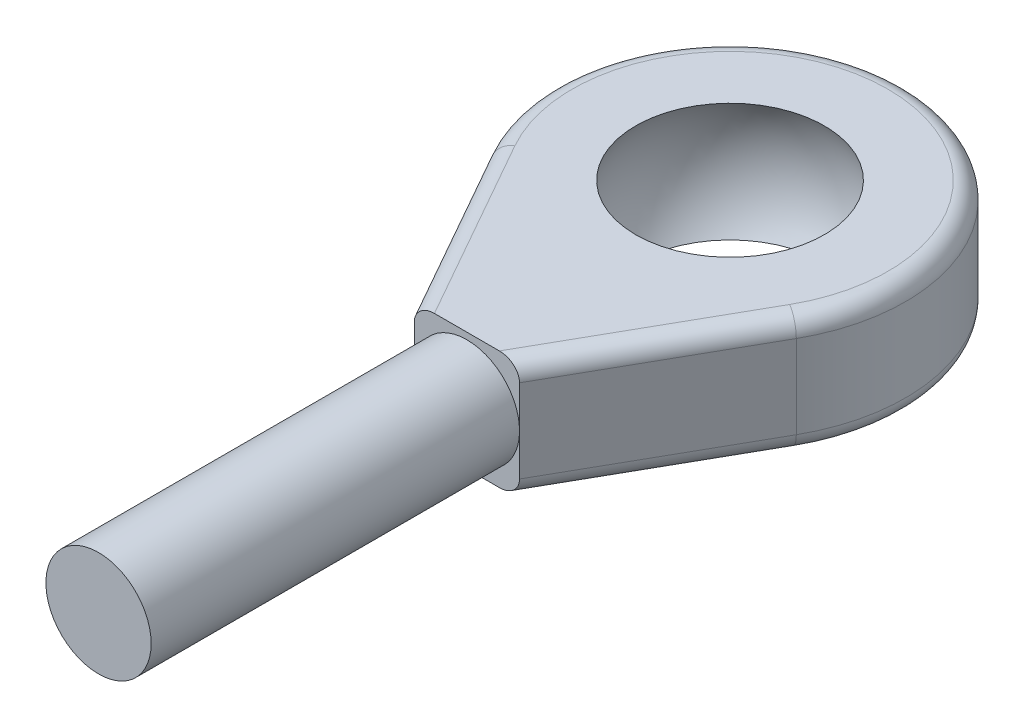
ISO-10303-21;
HEADER;
FILE_DESCRIPTION(('STEP AP214'),'2;1');
FILE_NAME('part.step','',(''),(''),'','','');
FILE_SCHEMA(('AUTOMOTIVE_DESIGN { 1 0 10303 214 1 1 1 1 }'));
ENDSEC;
DATA;
#1=APPLICATION_CONTEXT('core data for automotive mechanical design processes');
#2=APPLICATION_PROTOCOL_DEFINITION('international standard','automotive_design',2000,#1);
#3=PRODUCT_CONTEXT('',#1,'mechanical');
#4=PRODUCT('Part','Part','',(#3));
#5=PRODUCT_RELATED_PRODUCT_CATEGORY('part','',(#4));
#6=PRODUCT_DEFINITION_FORMATION('','',#4);
#7=PRODUCT_DEFINITION_CONTEXT('part definition',#1,'design');
#8=PRODUCT_DEFINITION('design','',#6,#7);
#9=PRODUCT_DEFINITION_SHAPE('','',#8);
#10=(LENGTH_UNIT() NAMED_UNIT(*) SI_UNIT(.MILLI.,.METRE.));
#11=(NAMED_UNIT(*) PLANE_ANGLE_UNIT() SI_UNIT($,.RADIAN.));
#12=(NAMED_UNIT(*) SI_UNIT($,.STERADIAN.) SOLID_ANGLE_UNIT());
#13=UNCERTAINTY_MEASURE_WITH_UNIT(LENGTH_MEASURE(1.E-05),#10,'distance_accuracy_value','');
#14=(GEOMETRIC_REPRESENTATION_CONTEXT(3) GLOBAL_UNCERTAINTY_ASSIGNED_CONTEXT((#13)) GLOBAL_UNIT_ASSIGNED_CONTEXT((#10,
#11,#12)) REPRESENTATION_CONTEXT('',''));
#15=CARTESIAN_POINT('',(0.,0.,0.));
#16=DIRECTION('',(0.,0.,1.));
#17=DIRECTION('',(1.,0.,0.));
#18=AXIS2_PLACEMENT_3D('',#15,#16,#17);
#19=CARTESIAN_POINT('',(-3.,3.375,15.));
#20=DIRECTION('',(0.,0.,-1.));
#21=DIRECTION('',(-1.,0.,0.));
#22=AXIS2_PLACEMENT_3D('',#19,#20,#21);
#23=PLANE('',#22);
#24=CARTESIAN_POINT('',(0.,0.,15.));
#25=DIRECTION('',(0.,0.,1.));
#26=DIRECTION('',(1.,0.,0.));
#27=AXIS2_PLACEMENT_3D('',#24,#25,#26);
#28=CIRCLE('',#27,3.);
#29=CARTESIAN_POINT('',(3.,0.,15.));
#30=VERTEX_POINT('',#29);
#31=CARTESIAN_POINT('',(-3.,0.,15.));
#32=VERTEX_POINT('',#31);
#33=EDGE_CURVE('E47',#30,#32,#28,.T.);
#34=ORIENTED_EDGE('',*,*,#33,.F.);
#35=DIRECTION('',(0.,-1.,0.));
#36=VECTOR('',#35,1.);
#37=CARTESIAN_POINT('',(3.,3.375,15.));
#38=LINE('',#37,#36);
#39=CARTESIAN_POINT('',(3.,2.375,15.));
#40=VERTEX_POINT('',#39);
#41=EDGE_CURVE('E108',#40,#30,#38,.T.);
#42=ORIENTED_EDGE('',*,*,#41,.F.);
#43=CARTESIAN_POINT('',(1.85089957166518,2.375,15.));
#44=DIRECTION('',(0.,0.,-1.));
#45=DIRECTION('',(-1.,0.,0.));
#46=AXIS2_PLACEMENT_3D('',#43,#44,#45);
#47=ELLIPSE('',#46,1.14910042833483,1.);
#48=CARTESIAN_POINT('',(1.85089957166518,3.375,15.));
#49=VERTEX_POINT('',#48);
#50=EDGE_CURVE('E218',#40,#49,#47,.F.);
#51=ORIENTED_EDGE('',*,*,#50,.T.);
#52=DIRECTION('',(1.,0.,0.));
#53=VECTOR('',#52,1.);
#54=CARTESIAN_POINT('',(-3.,3.375,15.));
#55=LINE('',#54,#53);
#56=CARTESIAN_POINT('',(-1.85089957166517,3.375,15.));
#57=VERTEX_POINT('',#56);
#58=EDGE_CURVE('E240',#57,#49,#55,.T.);
#59=ORIENTED_EDGE('',*,*,#58,.F.);
#60=CARTESIAN_POINT('',(-1.85089957166517,2.375,15.));
#61=DIRECTION('',(0.,0.,-1.));
#62=DIRECTION('',(-1.,0.,0.));
#63=AXIS2_PLACEMENT_3D('',#60,#61,#62);
#64=ELLIPSE('',#63,1.14910042833483,1.);
#65=CARTESIAN_POINT('',(-3.,2.375,15.));
#66=VERTEX_POINT('',#65);
#67=EDGE_CURVE('E216',#57,#66,#64,.F.);
#68=ORIENTED_EDGE('',*,*,#67,.T.);
#69=DIRECTION('',(0.,-1.,0.));
#70=VECTOR('',#69,1.);
#71=CARTESIAN_POINT('',(-3.,3.375,15.));
#72=LINE('',#71,#70);
#73=EDGE_CURVE('E130',#66,#32,#72,.T.);
#74=ORIENTED_EDGE('',*,*,#73,.T.);
#75=EDGE_LOOP('',(#34,#42,#51,#59,#68,#74));
#76=FACE_BOUND('',#75,.T.);
#77=ADVANCED_FACE('F36',(#76),#23,.F.);
#78=CARTESIAN_POINT('',(-3.,3.375,15.));
#79=DIRECTION('',(0.870245955307066,0.,-0.492617475605254));
#80=DIRECTION('',(-0.492617475605254,0.,-0.870245955307066));
#81=AXIS2_PLACEMENT_3D('',#78,#79,#80);
#82=PLANE('',#81);
#83=ORIENTED_EDGE('',*,*,#73,.F.);
#84=DIRECTION('',(0.492617475605254,0.,0.870245955307066));
#85=VECTOR('',#84,1.);
#86=CARTESIAN_POINT('',(-8.70245955307066,2.375,4.92617475605254));
#87=LINE('',#86,#85);
#88=CARTESIAN_POINT('',(-8.70245955307066,2.375,4.92617475605254));
#89=VERTEX_POINT('',#88);
#90=EDGE_CURVE('E223',#66,#89,#87,.F.);
#91=ORIENTED_EDGE('',*,*,#90,.T.);
#92=DIRECTION('',(0.,-1.,0.));
#93=VECTOR('',#92,1.);
#94=CARTESIAN_POINT('',(-8.70245955307066,3.375,4.92617475605254));
#95=LINE('',#94,#93);
#96=CARTESIAN_POINT('',(-8.70245955307066,-2.375,4.92617475605254));
#97=VERTEX_POINT('',#96);
#98=EDGE_CURVE('E243',#89,#97,#95,.T.);
#99=ORIENTED_EDGE('',*,*,#98,.T.);
#100=DIRECTION('',(0.492617475605254,0.,0.870245955307066));
#101=VECTOR('',#100,1.);
#102=CARTESIAN_POINT('',(-3.,-2.375,15.));
#103=LINE('',#102,#101);
#104=CARTESIAN_POINT('',(-3.,-2.375,15.));
#105=VERTEX_POINT('',#104);
#106=EDGE_CURVE('E220',#97,#105,#103,.T.);
#107=ORIENTED_EDGE('',*,*,#106,.T.);
#108=EDGE_CURVE('E119',#32,#105,#72,.T.);
#109=ORIENTED_EDGE('',*,*,#108,.F.);
#110=EDGE_LOOP('',(#83,#91,#99,#107,#109));
#111=FACE_BOUND('',#110,.T.);
#112=ADVANCED_FACE('F151',(#111),#82,.F.);
#113=EDGE_CURVE('E11',#32,#30,#28,.T.);
#114=ORIENTED_EDGE('',*,*,#113,.F.);
#115=ORIENTED_EDGE('',*,*,#108,.T.);
#116=CARTESIAN_POINT('',(-1.85089957166517,-2.375,15.));
#117=DIRECTION('',(0.,0.,-1.));
#118=DIRECTION('',(1.,0.,0.));
#119=AXIS2_PLACEMENT_3D('',#116,#117,#118);
#120=ELLIPSE('',#119,1.14910042833483,1.);
#121=CARTESIAN_POINT('',(-1.85089957166517,-3.375,15.));
#122=VERTEX_POINT('',#121);
#123=EDGE_CURVE('E213',#105,#122,#120,.F.);
#124=ORIENTED_EDGE('',*,*,#123,.T.);
#125=DIRECTION('',(1.,0.,0.));
#126=VECTOR('',#125,1.);
#127=CARTESIAN_POINT('',(-3.,-3.375,15.));
#128=LINE('',#127,#126);
#129=CARTESIAN_POINT('',(1.85089957166518,-3.375,15.));
#130=VERTEX_POINT('',#129);
#131=EDGE_CURVE('E196',#122,#130,#128,.T.);
#132=ORIENTED_EDGE('',*,*,#131,.T.);
#133=CARTESIAN_POINT('',(1.85089957166518,-2.375,15.));
#134=DIRECTION('',(0.,0.,-1.));
#135=DIRECTION('',(1.,0.,0.));
#136=AXIS2_PLACEMENT_3D('',#133,#134,#135);
#137=ELLIPSE('',#136,1.14910042833483,1.);
#138=CARTESIAN_POINT('',(3.,-2.375,15.));
#139=VERTEX_POINT('',#138);
#140=EDGE_CURVE('E124',#130,#139,#137,.F.);
#141=ORIENTED_EDGE('',*,*,#140,.T.);
#142=EDGE_CURVE('E112',#30,#139,#38,.T.);
#143=ORIENTED_EDGE('',*,*,#142,.F.);
#144=EDGE_LOOP('',(#114,#115,#124,#132,#141,#143));
#145=FACE_BOUND('',#144,.T.);
#146=ADVANCED_FACE('F121',(#145),#23,.F.);
#147=CARTESIAN_POINT('',(3.,3.375,15.));
#148=DIRECTION('',(-0.870245955307066,0.,-0.492617475605254));
#149=DIRECTION('',(-0.492617475605254,0.,0.870245955307066));
#150=AXIS2_PLACEMENT_3D('',#147,#148,#149);
#151=PLANE('',#150);
#152=DIRECTION('',(0.,-1.,0.));
#153=VECTOR('',#152,1.);
#154=CARTESIAN_POINT('',(8.70245955307066,3.375,4.92617475605254));
#155=LINE('',#154,#153);
#156=CARTESIAN_POINT('',(8.70245955307066,2.375,4.92617475605254));
#157=VERTEX_POINT('',#156);
#158=CARTESIAN_POINT('',(8.70245955307066,-2.375,4.92617475605254));
#159=VERTEX_POINT('',#158);
#160=EDGE_CURVE('E126',#157,#159,#155,.T.);
#161=ORIENTED_EDGE('',*,*,#160,.F.);
#162=DIRECTION('',(0.492617475605254,0.,-0.870245955307066));
#163=VECTOR('',#162,1.);
#164=CARTESIAN_POINT('',(3.,2.375,15.));
#165=LINE('',#164,#163);
#166=EDGE_CURVE('E115',#157,#40,#165,.F.);
#167=ORIENTED_EDGE('',*,*,#166,.T.);
#168=ORIENTED_EDGE('',*,*,#41,.T.);
#169=ORIENTED_EDGE('',*,*,#142,.T.);
#170=DIRECTION('',(0.492617475605254,0.,-0.870245955307066));
#171=VECTOR('',#170,1.);
#172=CARTESIAN_POINT('',(3.,-2.375,15.));
#173=LINE('',#172,#171);
#174=EDGE_CURVE('E210',#139,#159,#173,.T.);
#175=ORIENTED_EDGE('',*,*,#174,.T.);
#176=EDGE_LOOP('',(#161,#167,#168,#169,#175));
#177=FACE_BOUND('',#176,.T.);
#178=ADVANCED_FACE('F110',(#177),#151,.F.);
#179=CARTESIAN_POINT('',(0.,3.375,0.));
#180=DIRECTION('',(0.,-1.,0.));
#181=DIRECTION('',(0.,0.,-1.));
#182=AXIS2_PLACEMENT_3D('',#179,#180,#181);
#183=CYLINDRICAL_SURFACE('',#182,10.);
#184=ORIENTED_EDGE('',*,*,#98,.F.);
#185=CARTESIAN_POINT('',(0.,2.375,0.));
#186=DIRECTION('',(0.,1.,0.));
#187=DIRECTION('',(0.,0.,1.));
#188=AXIS2_PLACEMENT_3D('',#185,#186,#187);
#189=CIRCLE('',#188,10.);
#190=EDGE_CURVE('E45',#89,#157,#189,.F.);
#191=ORIENTED_EDGE('',*,*,#190,.T.);
#192=ORIENTED_EDGE('',*,*,#160,.T.);
#193=CARTESIAN_POINT('',(0.,-2.375,0.));
#194=DIRECTION('',(0.,1.,0.));
#195=DIRECTION('',(0.,0.,1.));
#196=AXIS2_PLACEMENT_3D('',#193,#194,#195);
#197=CIRCLE('',#196,10.);
#198=EDGE_CURVE('E230',#159,#97,#197,.T.);
#199=ORIENTED_EDGE('',*,*,#198,.T.);
#200=EDGE_LOOP('',(#184,#191,#192,#199));
#201=FACE_BOUND('',#200,.T.);
#202=ADVANCED_FACE('F163',(#201),#183,.T.);
#203=CARTESIAN_POINT('',(0.,3.375,0.));
#204=DIRECTION('',(0.,1.,0.));
#205=DIRECTION('',(0.,0.,1.));
#206=AXIS2_PLACEMENT_3D('',#203,#204,#205);
#207=PLANE('',#206);
#208=ORIENTED_EDGE('',*,*,#58,.T.);
#209=DIRECTION('',(0.492617475605254,0.,-0.870245955307066));
#210=VECTOR('',#209,1.);
#211=CARTESIAN_POINT('',(7.83221359776359,3.375,4.43355728044728));
#212=LINE('',#211,#210);
#213=CARTESIAN_POINT('',(7.83221359776359,3.375,4.43355728044728));
#214=VERTEX_POINT('',#213);
#215=EDGE_CURVE('E207',#49,#214,#212,.T.);
#216=ORIENTED_EDGE('',*,*,#215,.T.);
#217=CARTESIAN_POINT('',(0.,3.375,0.));
#218=DIRECTION('',(0.,1.,0.));
#219=DIRECTION('',(0.,0.,1.));
#220=AXIS2_PLACEMENT_3D('',#217,#218,#219);
#221=CIRCLE('',#220,9.);
#222=CARTESIAN_POINT('',(-7.83221359776359,3.375,4.43355728044728));
#223=VERTEX_POINT('',#222);
#224=EDGE_CURVE('E203',#214,#223,#221,.T.);
#225=ORIENTED_EDGE('',*,*,#224,.T.);
#226=DIRECTION('',(0.492617475605254,0.,0.870245955307066));
#227=VECTOR('',#226,1.);
#228=CARTESIAN_POINT('',(-2.12975404469293,3.375,14.5073825243947));
#229=LINE('',#228,#227);
#230=EDGE_CURVE('E205',#223,#57,#229,.T.);
#231=ORIENTED_EDGE('',*,*,#230,.T.);
#232=EDGE_LOOP('',(#208,#216,#225,#231));
#233=FACE_BOUND('',#232,.T.);
#234=CARTESIAN_POINT('',(0.,3.375,0.));
#235=DIRECTION('',(0.,1.,0.));
#236=DIRECTION('',(0.,0.,1.));
#237=AXIS2_PLACEMENT_3D('',#234,#235,#236);
#238=CIRCLE('',#237,5.37883584058856);
#239=CARTESIAN_POINT('',(0.,3.375,5.37883584058856));
#240=VERTEX_POINT('',#239);
#241=EDGE_CURVE('E190',#240,#240,#238,.F.);
#242=ORIENTED_EDGE('',*,*,#241,.T.);
#243=EDGE_LOOP('',(#242));
#244=FACE_BOUND('',#243,.T.);
#245=ADVANCED_FACE('F167',(#233,#244),#207,.T.);
#246=CARTESIAN_POINT('',(0.,-3.375,0.));
#247=DIRECTION('',(0.,1.,0.));
#248=DIRECTION('',(0.,0.,1.));
#249=AXIS2_PLACEMENT_3D('',#246,#247,#248);
#250=PLANE('',#249);
#251=CARTESIAN_POINT('',(0.,-3.375,0.));
#252=DIRECTION('',(0.,1.,0.));
#253=DIRECTION('',(0.,0.,1.));
#254=AXIS2_PLACEMENT_3D('',#251,#252,#253);
#255=CIRCLE('',#254,5.37883584058856);
#256=CARTESIAN_POINT('',(0.,-3.375,5.37883584058856));
#257=VERTEX_POINT('',#256);
#258=EDGE_CURVE('E193',#257,#257,#255,.F.);
#259=ORIENTED_EDGE('',*,*,#258,.F.);
#260=EDGE_LOOP('',(#259));
#261=FACE_BOUND('',#260,.T.);
#262=CARTESIAN_POINT('',(0.,-3.375,0.));
#263=DIRECTION('',(0.,1.,0.));
#264=DIRECTION('',(0.,0.,1.));
#265=AXIS2_PLACEMENT_3D('',#262,#263,#264);
#266=CIRCLE('',#265,9.);
#267=CARTESIAN_POINT('',(-7.83221359776359,-3.375,4.43355728044728));
#268=VERTEX_POINT('',#267);
#269=CARTESIAN_POINT('',(7.83221359776359,-3.375,4.43355728044728));
#270=VERTEX_POINT('',#269);
#271=EDGE_CURVE('E60',#268,#270,#266,.F.);
#272=ORIENTED_EDGE('',*,*,#271,.T.);
#273=DIRECTION('',(0.492617475605254,0.,-0.870245955307066));
#274=VECTOR('',#273,1.);
#275=CARTESIAN_POINT('',(7.83221359776359,-3.375,4.43355728044728));
#276=LINE('',#275,#274);
#277=EDGE_CURVE('E228',#270,#130,#276,.F.);
#278=ORIENTED_EDGE('',*,*,#277,.T.);
#279=ORIENTED_EDGE('',*,*,#131,.F.);
#280=DIRECTION('',(0.492617475605254,0.,0.870245955307066));
#281=VECTOR('',#280,1.);
#282=CARTESIAN_POINT('',(-7.83221359776359,-3.375,4.43355728044728));
#283=LINE('',#282,#281);
#284=EDGE_CURVE('E226',#122,#268,#283,.F.);
#285=ORIENTED_EDGE('',*,*,#284,.T.);
#286=EDGE_LOOP('',(#272,#278,#279,#285));
#287=FACE_BOUND('',#286,.T.);
#288=ADVANCED_FACE('F171',(#261,#287),#250,.F.);
#289=CARTESIAN_POINT('',(0.,0.,0.));
#290=DIRECTION('',(0.,1.,0.));
#291=DIRECTION('',(0.,0.,-1.));
#292=AXIS2_PLACEMENT_3D('',#289,#290,#291);
#293=SPHERICAL_SURFACE('',#292,6.35);
#294=ORIENTED_EDGE('',*,*,#241,.F.);
#295=EDGE_LOOP('',(#294));
#296=FACE_BOUND('',#295,.T.);
#297=ORIENTED_EDGE('',*,*,#258,.T.);
#298=EDGE_LOOP('',(#297));
#299=FACE_BOUND('',#298,.T.);
#300=ADVANCED_FACE('F174',(#296,#299),#293,.F.);
#301=CARTESIAN_POINT('',(-7.83221359776359,2.375,4.43355728044728));
#302=DIRECTION('',(-0.492617475605254,0.,-0.870245955307066));
#303=DIRECTION('',(-0.870245955307066,0.,0.492617475605254));
#304=AXIS2_PLACEMENT_3D('',#301,#302,#303);
#305=CYLINDRICAL_SURFACE('',#304,1.);
#306=ORIENTED_EDGE('',*,*,#67,.F.);
#307=ORIENTED_EDGE('',*,*,#230,.F.);
#308=CARTESIAN_POINT('',(-7.83221359776359,2.375,4.43355728044728));
#309=DIRECTION('',(-0.492617475605253,0.,-0.870245955307066));
#310=DIRECTION('',(-0.870245955307066,0.,0.492617475605253));
#311=AXIS2_PLACEMENT_3D('',#308,#309,#310);
#312=CIRCLE('',#311,1.);
#313=EDGE_CURVE('E194',#89,#223,#312,.T.);
#314=ORIENTED_EDGE('',*,*,#313,.F.);
#315=ORIENTED_EDGE('',*,*,#90,.F.);
#316=EDGE_LOOP('',(#306,#307,#314,#315));
#317=FACE_BOUND('',#316,.T.);
#318=ADVANCED_FACE('F179',(#317),#305,.T.);
#319=CARTESIAN_POINT('',(0.,2.375,0.));
#320=DIRECTION('',(0.,1.,0.));
#321=DIRECTION('',(0.,0.,1.));
#322=AXIS2_PLACEMENT_3D('',#319,#320,#321);
#323=TOROIDAL_SURFACE('',#322,9.,1.);
#324=ORIENTED_EDGE('',*,*,#313,.T.);
#325=ORIENTED_EDGE('',*,*,#224,.F.);
#326=CARTESIAN_POINT('',(7.83221359776359,2.375,4.43355728044728));
#327=DIRECTION('',(-0.492617475605253,0.,0.870245955307066));
#328=DIRECTION('',(0.870245955307066,0.,0.492617475605253));
#329=AXIS2_PLACEMENT_3D('',#326,#327,#328);
#330=CIRCLE('',#329,1.);
#331=EDGE_CURVE('E199',#157,#214,#330,.T.);
#332=ORIENTED_EDGE('',*,*,#331,.F.);
#333=ORIENTED_EDGE('',*,*,#190,.F.);
#334=EDGE_LOOP('',(#324,#325,#332,#333));
#335=FACE_BOUND('',#334,.T.);
#336=ADVANCED_FACE('F184',(#335),#323,.T.);
#337=CARTESIAN_POINT('',(7.83221359776359,2.375,4.43355728044728));
#338=DIRECTION('',(-0.492617475605254,0.,0.870245955307066));
#339=DIRECTION('',(0.870245955307066,0.,0.492617475605254));
#340=AXIS2_PLACEMENT_3D('',#337,#338,#339);
#341=CYLINDRICAL_SURFACE('',#340,1.);
#342=ORIENTED_EDGE('',*,*,#50,.F.);
#343=ORIENTED_EDGE('',*,*,#166,.F.);
#344=ORIENTED_EDGE('',*,*,#331,.T.);
#345=ORIENTED_EDGE('',*,*,#215,.F.);
#346=EDGE_LOOP('',(#342,#343,#344,#345));
#347=FACE_BOUND('',#346,.T.);
#348=ADVANCED_FACE('F252',(#347),#341,.T.);
#349=CARTESIAN_POINT('',(-2.12975404469293,-2.375,14.5073825243947));
#350=DIRECTION('',(0.492617475605254,0.,0.870245955307066));
#351=DIRECTION('',(0.870245955307066,0.,-0.492617475605254));
#352=AXIS2_PLACEMENT_3D('',#349,#350,#351);
#353=CYLINDRICAL_SURFACE('',#352,1.);
#354=ORIENTED_EDGE('',*,*,#123,.F.);
#355=ORIENTED_EDGE('',*,*,#106,.F.);
#356=CARTESIAN_POINT('',(-7.83221359776359,-2.375,4.43355728044728));
#357=DIRECTION('',(-0.492617475605253,0.,-0.870245955307066));
#358=DIRECTION('',(-0.870245955307066,0.,0.492617475605253));
#359=AXIS2_PLACEMENT_3D('',#356,#357,#358);
#360=CIRCLE('',#359,1.);
#361=EDGE_CURVE('E40',#268,#97,#360,.T.);
#362=ORIENTED_EDGE('',*,*,#361,.F.);
#363=ORIENTED_EDGE('',*,*,#284,.F.);
#364=EDGE_LOOP('',(#354,#355,#362,#363));
#365=FACE_BOUND('',#364,.T.);
#366=ADVANCED_FACE('F38',(#365),#353,.T.);
#367=CARTESIAN_POINT('',(0.,-2.375,0.));
#368=DIRECTION('',(0.,1.,0.));
#369=DIRECTION('',(0.,0.,1.));
#370=AXIS2_PLACEMENT_3D('',#367,#368,#369);
#371=TOROIDAL_SURFACE('',#370,9.,1.);
#372=ORIENTED_EDGE('',*,*,#361,.T.);
#373=ORIENTED_EDGE('',*,*,#198,.F.);
#374=CARTESIAN_POINT('',(7.83221359776359,-2.375,4.43355728044728));
#375=DIRECTION('',(-0.492617475605253,0.,0.870245955307066));
#376=DIRECTION('',(0.870245955307066,0.,0.492617475605253));
#377=AXIS2_PLACEMENT_3D('',#374,#375,#376);
#378=CIRCLE('',#377,1.);
#379=EDGE_CURVE('E233',#270,#159,#378,.T.);
#380=ORIENTED_EDGE('',*,*,#379,.F.);
#381=ORIENTED_EDGE('',*,*,#271,.F.);
#382=EDGE_LOOP('',(#372,#373,#380,#381));
#383=FACE_BOUND('',#382,.T.);
#384=ADVANCED_FACE('F145',(#383),#371,.T.);
#385=CARTESIAN_POINT('',(2.12975404469294,-2.375,14.5073825243947));
#386=DIRECTION('',(0.492617475605254,0.,-0.870245955307066));
#387=DIRECTION('',(-0.870245955307066,0.,-0.492617475605254));
#388=AXIS2_PLACEMENT_3D('',#385,#386,#387);
#389=CYLINDRICAL_SURFACE('',#388,1.);
#390=ORIENTED_EDGE('',*,*,#140,.F.);
#391=ORIENTED_EDGE('',*,*,#277,.F.);
#392=ORIENTED_EDGE('',*,*,#379,.T.);
#393=ORIENTED_EDGE('',*,*,#174,.F.);
#394=EDGE_LOOP('',(#390,#391,#392,#393));
#395=FACE_BOUND('',#394,.T.);
#396=ADVANCED_FACE('F136',(#395),#389,.T.);
#397=CARTESIAN_POINT('',(0.,0.,36.));
#398=DIRECTION('',(0.,0.,-1.));
#399=DIRECTION('',(-1.,0.,0.));
#400=AXIS2_PLACEMENT_3D('',#397,#398,#399);
#401=CYLINDRICAL_SURFACE('',#400,3.);
#402=CARTESIAN_POINT('',(0.,0.,36.));
#403=DIRECTION('',(0.,0.,1.));
#404=DIRECTION('',(1.,0.,0.));
#405=AXIS2_PLACEMENT_3D('',#402,#403,#404);
#406=CIRCLE('',#405,3.);
#407=CARTESIAN_POINT('',(3.,0.,36.));
#408=VERTEX_POINT('',#407);
#409=EDGE_CURVE('E132',#408,#408,#406,.T.);
#410=ORIENTED_EDGE('',*,*,#409,.F.);
#411=EDGE_LOOP('',(#410));
#412=FACE_BOUND('',#411,.T.);
#413=ORIENTED_EDGE('',*,*,#33,.T.);
#414=ORIENTED_EDGE('',*,*,#113,.T.);
#415=EDGE_LOOP('',(#413,#414));
#416=FACE_BOUND('',#415,.T.);
#417=ADVANCED_FACE('F133',(#412,#416),#401,.T.);
#418=CARTESIAN_POINT('',(0.,0.,36.));
#419=DIRECTION('',(0.,0.,1.));
#420=DIRECTION('',(1.,0.,0.));
#421=AXIS2_PLACEMENT_3D('',#418,#419,#420);
#422=PLANE('',#421);
#423=ORIENTED_EDGE('',*,*,#409,.T.);
#424=EDGE_LOOP('',(#423));
#425=FACE_BOUND('',#424,.T.);
#426=ADVANCED_FACE('F135',(#425),#422,.T.);
#427=CLOSED_SHELL('',(#77,#112,#146,#178,#202,#245,#288,#300,#318,#336,#348,#366,#384,#396,#417,#426));
#428=MANIFOLD_SOLID_BREP('B2',#427);
#429=ADVANCED_BREP_SHAPE_REPRESENTATION('',(#18,#428),#14);
#430=SHAPE_DEFINITION_REPRESENTATION(#9,#429);
ENDSEC;
END-ISO-10303-21;
